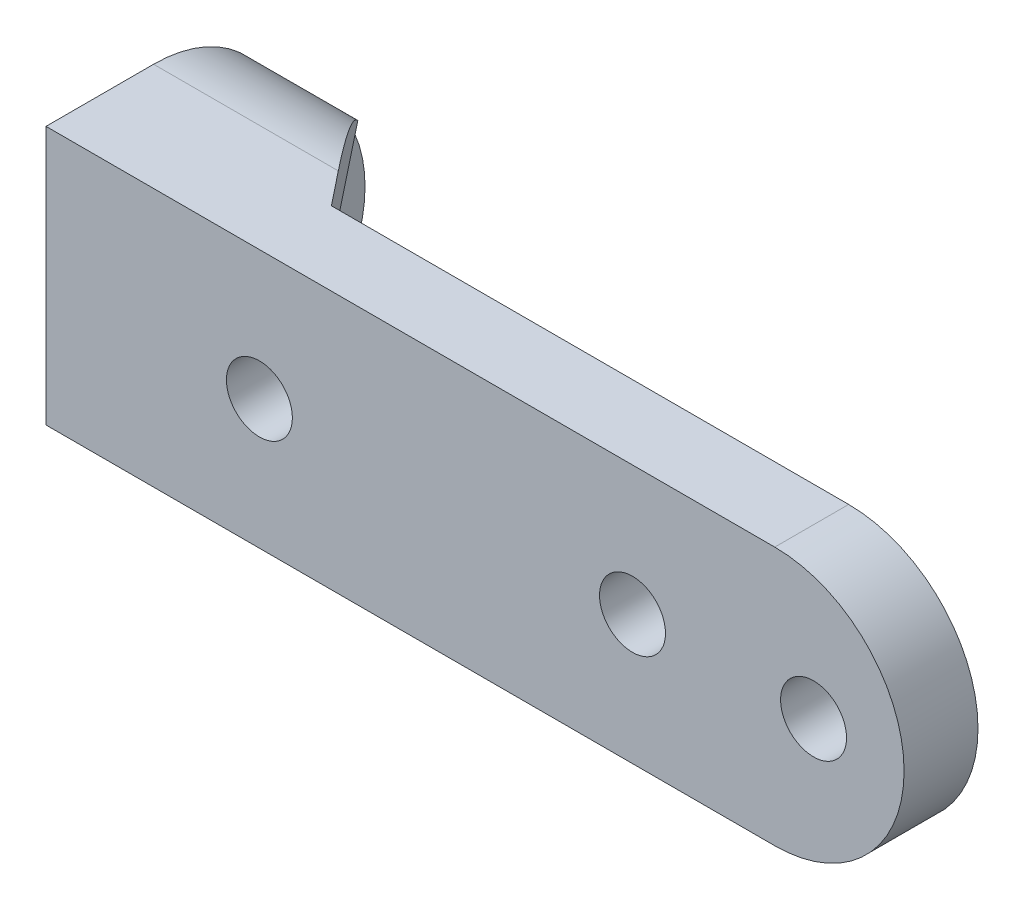
ISO-10303-21;
HEADER;
FILE_DESCRIPTION(('STEP AP214'),'2;1');
FILE_NAME('part.step','',(''),(''),'','','');
FILE_SCHEMA(('AUTOMOTIVE_DESIGN { 1 0 10303 214 1 1 1 1 }'));
ENDSEC;
DATA;
#1=APPLICATION_CONTEXT('core data for automotive mechanical design processes');
#2=APPLICATION_PROTOCOL_DEFINITION('international standard','automotive_design',2000,#1);
#3=PRODUCT_CONTEXT('',#1,'mechanical');
#4=PRODUCT('Part','Part','',(#3));
#5=PRODUCT_RELATED_PRODUCT_CATEGORY('part','',(#4));
#6=PRODUCT_DEFINITION_FORMATION('','',#4);
#7=PRODUCT_DEFINITION_CONTEXT('part definition',#1,'design');
#8=PRODUCT_DEFINITION('design','',#6,#7);
#9=PRODUCT_DEFINITION_SHAPE('','',#8);
#10=(LENGTH_UNIT() NAMED_UNIT(*) SI_UNIT(.MILLI.,.METRE.));
#11=(NAMED_UNIT(*) PLANE_ANGLE_UNIT() SI_UNIT($,.RADIAN.));
#12=(NAMED_UNIT(*) SI_UNIT($,.STERADIAN.) SOLID_ANGLE_UNIT());
#13=UNCERTAINTY_MEASURE_WITH_UNIT(LENGTH_MEASURE(1.E-05),#10,'distance_accuracy_value','');
#14=(GEOMETRIC_REPRESENTATION_CONTEXT(3) GLOBAL_UNCERTAINTY_ASSIGNED_CONTEXT((#13)) GLOBAL_UNIT_ASSIGNED_CONTEXT((#10,
#11,#12)) REPRESENTATION_CONTEXT('',''));
#15=CARTESIAN_POINT('',(0.,0.,0.));
#16=DIRECTION('',(0.,0.,1.));
#17=DIRECTION('',(1.,0.,0.));
#18=AXIS2_PLACEMENT_3D('',#15,#16,#17);
#19=CARTESIAN_POINT('',(-10.882391074901,-6.825,8.63418757078096));
#20=DIRECTION('',(-0.783381109212275,0.,0.621541662102667));
#21=DIRECTION('',(0.621541662102667,0.,0.783381109212275));
#22=AXIS2_PLACEMENT_3D('',#19,#20,#21);
#23=PLANE('',#22);
#24=CARTESIAN_POINT('',(-22.0659094941968,0.,-5.46133908235703));
#25=DIRECTION('',(-0.783381109212275,0.,0.621541662102667));
#26=DIRECTION('',(-0.621541662102667,0.,-0.783381109212275));
#27=AXIS2_PLACEMENT_3D('',#24,#25,#26);
#28=ELLIPSE('',#27,12.7651788923726,10.);
#29=CARTESIAN_POINT('',(-27.8648219381481,-6.82500000000001,-12.770195011981));
#30=VERTEX_POINT('',#29);
#31=CARTESIAN_POINT('',(-22.0659094941968,-10.,-5.46133908235703));
#32=VERTEX_POINT('',#31);
#33=EDGE_CURVE('E194',#30,#32,#28,.T.);
#34=ORIENTED_EDGE('',*,*,#33,.F.);
#35=DIRECTION('',(-0.621541662102668,0.,-0.783381109212275));
#36=VECTOR('',#35,1.);
#37=CARTESIAN_POINT('',(-10.882391074901,-6.825,8.63418757078096));
#38=LINE('',#37,#36);
#39=CARTESIAN_POINT('',(-21.5868181011606,-6.825,-4.8575));
#40=VERTEX_POINT('',#39);
#41=EDGE_CURVE('E205',#40,#30,#38,.T.);
#42=ORIENTED_EDGE('',*,*,#41,.F.);
#43=CARTESIAN_POINT('',(-21.5868181011606,-4.825,-4.8575));
#44=DIRECTION('',(-0.783381109212275,0.,0.621541662102667));
#45=DIRECTION('',(0.621541662102667,0.,0.783381109212275));
#46=AXIS2_PLACEMENT_3D('',#43,#44,#45);
#47=ELLIPSE('',#46,2.55303577847453,2.);
#48=CARTESIAN_POINT('',(-20.,-4.825,-2.8575));
#49=VERTEX_POINT('',#48);
#50=EDGE_CURVE('E302',#40,#49,#47,.T.);
#51=ORIENTED_EDGE('',*,*,#50,.T.);
#52=DIRECTION('',(0.,-1.,0.));
#53=VECTOR('',#52,1.);
#54=CARTESIAN_POINT('',(-20.,-6.825,-2.8575));
#55=LINE('',#54,#53);
#56=CARTESIAN_POINT('',(-20.,-10.,-2.8575));
#57=VERTEX_POINT('',#56);
#58=EDGE_CURVE('E204',#49,#57,#55,.T.);
#59=ORIENTED_EDGE('',*,*,#58,.T.);
#60=DIRECTION('',(-0.621541662102668,0.,-0.783381109212275));
#61=VECTOR('',#60,1.);
#62=CARTESIAN_POINT('',(-10.882391074901,-10.,8.63418757078096));
#63=LINE('',#62,#61);
#64=EDGE_CURVE('E184',#57,#32,#63,.T.);
#65=ORIENTED_EDGE('',*,*,#64,.T.);
#66=EDGE_LOOP('',(#34,#42,#51,#59,#65));
#67=FACE_BOUND('',#66,.T.);
#68=ADVANCED_FACE('F76',(#67),#23,.F.);
#69=CARTESIAN_POINT('',(0.,-6.825,0.));
#70=DIRECTION('',(0.,-1.,0.));
#71=DIRECTION('',(-1.,0.,0.));
#72=AXIS2_PLACEMENT_3D('',#69,#70,#71);
#73=PLANE('',#72);
#74=DIRECTION('',(0.,0.,-1.));
#75=VECTOR('',#74,1.);
#76=CARTESIAN_POINT('',(-28.,-6.825,0.));
#77=LINE('',#76,#75);
#78=CARTESIAN_POINT('',(-28.,-6.82500000000002,-12.770195011981));
#79=VERTEX_POINT('',#78);
#80=CARTESIAN_POINT('',(-28.,-6.825,-4.8575));
#81=VERTEX_POINT('',#80);
#82=EDGE_CURVE('E292',#79,#81,#77,.F.);
#83=ORIENTED_EDGE('',*,*,#82,.T.);
#84=DIRECTION('',(-1.,0.,0.));
#85=VECTOR('',#84,1.);
#86=CARTESIAN_POINT('',(-20.,-6.825,-4.8575));
#87=LINE('',#86,#85);
#88=EDGE_CURVE('E294',#81,#40,#87,.F.);
#89=ORIENTED_EDGE('',*,*,#88,.T.);
#90=ORIENTED_EDGE('',*,*,#41,.T.);
#91=DIRECTION('',(-1.,0.,0.));
#92=VECTOR('',#91,1.);
#93=CARTESIAN_POINT('',(30.,-6.82500000000001,-12.770195011981));
#94=LINE('',#93,#92);
#95=EDGE_CURVE('E197',#79,#30,#94,.F.);
#96=ORIENTED_EDGE('',*,*,#95,.F.);
#97=EDGE_LOOP('',(#83,#89,#90,#96));
#98=FACE_BOUND('',#97,.T.);
#99=ADVANCED_FACE('F344',(#98),#73,.F.);
#100=CARTESIAN_POINT('',(-10.882391074901,6.825,8.63418757078096));
#101=DIRECTION('',(0.783381109212275,0.,-0.621541662102667));
#102=DIRECTION('',(-0.621541662102667,0.,-0.783381109212275));
#103=AXIS2_PLACEMENT_3D('',#100,#101,#102);
#104=PLANE('',#103);
#105=DIRECTION('',(0.,1.,0.));
#106=VECTOR('',#105,1.);
#107=CARTESIAN_POINT('',(-20.,6.825,-2.8575));
#108=LINE('',#107,#106);
#109=CARTESIAN_POINT('',(-20.,4.825,-2.8575));
#110=VERTEX_POINT('',#109);
#111=CARTESIAN_POINT('',(-20.,10.,-2.8575));
#112=VERTEX_POINT('',#111);
#113=EDGE_CURVE('E215',#110,#112,#108,.T.);
#114=ORIENTED_EDGE('',*,*,#113,.F.);
#115=CARTESIAN_POINT('',(-21.5868181011606,4.825,-4.8575));
#116=DIRECTION('',(0.783381109212275,0.,-0.621541662102667));
#117=DIRECTION('',(0.621541662102667,0.,0.783381109212275));
#118=AXIS2_PLACEMENT_3D('',#115,#116,#117);
#119=ELLIPSE('',#118,2.55303577847453,2.);
#120=CARTESIAN_POINT('',(-21.5868181011606,6.825,-4.8575));
#121=VERTEX_POINT('',#120);
#122=EDGE_CURVE('E300',#110,#121,#119,.F.);
#123=ORIENTED_EDGE('',*,*,#122,.T.);
#124=DIRECTION('',(-0.621541662102668,0.,-0.783381109212275));
#125=VECTOR('',#124,1.);
#126=CARTESIAN_POINT('',(-10.882391074901,6.825,8.63418757078096));
#127=LINE('',#126,#125);
#128=CARTESIAN_POINT('',(-27.8648219381481,6.825,-12.770195011981));
#129=VERTEX_POINT('',#128);
#130=EDGE_CURVE('E213',#121,#129,#127,.T.);
#131=ORIENTED_EDGE('',*,*,#130,.T.);
#132=CARTESIAN_POINT('',(-22.0659094941968,0.,-5.46133908235703));
#133=DIRECTION('',(0.783381109212275,0.,-0.621541662102667));
#134=DIRECTION('',(-0.621541662102667,0.,-0.783381109212275));
#135=AXIS2_PLACEMENT_3D('',#132,#133,#134);
#136=ELLIPSE('',#135,12.7651788923726,10.);
#137=CARTESIAN_POINT('',(-22.0659094941968,10.,-5.46133908235703));
#138=VERTEX_POINT('',#137);
#139=EDGE_CURVE('E200',#129,#138,#136,.T.);
#140=ORIENTED_EDGE('',*,*,#139,.T.);
#141=DIRECTION('',(-0.621541662102668,0.,-0.783381109212275));
#142=VECTOR('',#141,1.);
#143=CARTESIAN_POINT('',(-10.882391074901,10.,8.63418757078096));
#144=LINE('',#143,#142);
#145=EDGE_CURVE('E212',#112,#138,#144,.T.);
#146=ORIENTED_EDGE('',*,*,#145,.F.);
#147=EDGE_LOOP('',(#114,#123,#131,#140,#146));
#148=FACE_BOUND('',#147,.T.);
#149=ADVANCED_FACE('F349',(#148),#104,.T.);
#150=CARTESIAN_POINT('',(0.,6.825,0.));
#151=DIRECTION('',(0.,1.,0.));
#152=DIRECTION('',(-1.,0.,0.));
#153=AXIS2_PLACEMENT_3D('',#150,#151,#152);
#154=PLANE('',#153);
#155=ORIENTED_EDGE('',*,*,#130,.F.);
#156=DIRECTION('',(-1.,0.,0.));
#157=VECTOR('',#156,1.);
#158=CARTESIAN_POINT('',(-30.,6.825,-4.8575));
#159=LINE('',#158,#157);
#160=CARTESIAN_POINT('',(-28.,6.825,-4.8575));
#161=VERTEX_POINT('',#160);
#162=EDGE_CURVE('E282',#121,#161,#159,.T.);
#163=ORIENTED_EDGE('',*,*,#162,.T.);
#164=DIRECTION('',(0.,0.,-1.));
#165=VECTOR('',#164,1.);
#166=CARTESIAN_POINT('',(-28.,6.825,0.));
#167=LINE('',#166,#165);
#168=CARTESIAN_POINT('',(-28.,6.825,-12.770195011981));
#169=VERTEX_POINT('',#168);
#170=EDGE_CURVE('E277',#161,#169,#167,.T.);
#171=ORIENTED_EDGE('',*,*,#170,.T.);
#172=DIRECTION('',(-1.,0.,0.));
#173=VECTOR('',#172,1.);
#174=CARTESIAN_POINT('',(30.,6.82500000000001,-12.770195011981));
#175=LINE('',#174,#173);
#176=EDGE_CURVE('E266',#129,#169,#175,.T.);
#177=ORIENTED_EDGE('',*,*,#176,.F.);
#178=EDGE_LOOP('',(#155,#163,#171,#177));
#179=FACE_BOUND('',#178,.T.);
#180=ADVANCED_FACE('F353',(#179),#154,.F.);
#181=CARTESIAN_POINT('',(-30.,0.,0.));
#182=DIRECTION('',(1.,0.,0.));
#183=DIRECTION('',(0.,1.,0.));
#184=AXIS2_PLACEMENT_3D('',#181,#182,#183);
#185=PLANE('',#184);
#186=CARTESIAN_POINT('',(-30.,0.,-5.46133908235703));
#187=DIRECTION('',(1.,0.,0.));
#188=DIRECTION('',(0.,1.,0.));
#189=AXIS2_PLACEMENT_3D('',#186,#187,#188);
#190=CIRCLE('',#189,10.);
#191=CARTESIAN_POINT('',(-30.,-4.825,-14.22029878086));
#192=VERTEX_POINT('',#191);
#193=CARTESIAN_POINT('',(-30.,4.825,-14.22029878086));
#194=VERTEX_POINT('',#193);
#195=EDGE_CURVE('E189',#192,#194,#190,.T.);
#196=ORIENTED_EDGE('',*,*,#195,.T.);
#197=DIRECTION('',(0.,0.,-1.));
#198=VECTOR('',#197,1.);
#199=CARTESIAN_POINT('',(-30.,4.825,0.));
#200=LINE('',#199,#198);
#201=CARTESIAN_POINT('',(-30.,4.825,-4.8575));
#202=VERTEX_POINT('',#201);
#203=EDGE_CURVE('E99',#194,#202,#200,.F.);
#204=ORIENTED_EDGE('',*,*,#203,.T.);
#205=DIRECTION('',(0.,-1.,0.));
#206=VECTOR('',#205,1.);
#207=CARTESIAN_POINT('',(-30.,0.,-4.8575));
#208=LINE('',#207,#206);
#209=CARTESIAN_POINT('',(-30.,-4.825,-4.8575));
#210=VERTEX_POINT('',#209);
#211=EDGE_CURVE('E94',#202,#210,#208,.T.);
#212=ORIENTED_EDGE('',*,*,#211,.T.);
#213=DIRECTION('',(0.,0.,-1.));
#214=VECTOR('',#213,1.);
#215=CARTESIAN_POINT('',(-30.,-4.825,0.));
#216=LINE('',#215,#214);
#217=EDGE_CURVE('E297',#210,#192,#216,.T.);
#218=ORIENTED_EDGE('',*,*,#217,.T.);
#219=EDGE_LOOP('',(#196,#204,#212,#218));
#220=FACE_BOUND('',#219,.T.);
#221=CARTESIAN_POINT('',(-30.,0.,-9.14249999999994));
#222=DIRECTION('',(1.,0.,0.));
#223=DIRECTION('',(0.,1.,0.));
#224=AXIS2_PLACEMENT_3D('',#221,#222,#223);
#225=CIRCLE('',#224,2.55);
#226=CARTESIAN_POINT('',(-30.,2.55,-9.14249999999994));
#227=VERTEX_POINT('',#226);
#228=EDGE_CURVE('E219',#227,#227,#225,.T.);
#229=ORIENTED_EDGE('',*,*,#228,.F.);
#230=EDGE_LOOP('',(#229));
#231=FACE_BOUND('',#230,.T.);
#232=ADVANCED_FACE('F356',(#220,#231),#185,.T.);
#233=CARTESIAN_POINT('',(0.,0.,-2.8575));
#234=DIRECTION('',(0.,0.,1.));
#235=DIRECTION('',(1.,0.,0.));
#236=AXIS2_PLACEMENT_3D('',#233,#234,#235);
#237=PLANE('',#236);
#238=CARTESIAN_POINT('',(23.,0.,-2.8575));
#239=DIRECTION('',(0.,0.,1.));
#240=DIRECTION('',(1.,0.,0.));
#241=AXIS2_PLACEMENT_3D('',#238,#239,#240);
#242=CIRCLE('',#241,2.55);
#243=CARTESIAN_POINT('',(25.55,0.,-2.8575));
#244=VERTEX_POINT('',#243);
#245=EDGE_CURVE('E233',#244,#244,#242,.T.);
#246=ORIENTED_EDGE('',*,*,#245,.T.);
#247=EDGE_LOOP('',(#246));
#248=FACE_BOUND('',#247,.T.);
#249=CARTESIAN_POINT('',(9.,0.,-2.8575));
#250=DIRECTION('',(0.,0.,1.));
#251=DIRECTION('',(1.,0.,0.));
#252=AXIS2_PLACEMENT_3D('',#249,#250,#251);
#253=CIRCLE('',#252,2.55);
#254=CARTESIAN_POINT('',(11.55,0.,-2.8575));
#255=VERTEX_POINT('',#254);
#256=EDGE_CURVE('E234',#255,#255,#253,.T.);
#257=ORIENTED_EDGE('',*,*,#256,.T.);
#258=EDGE_LOOP('',(#257));
#259=FACE_BOUND('',#258,.T.);
#260=CARTESIAN_POINT('',(-19.85,0.,-2.8575));
#261=DIRECTION('',(0.,0.,1.));
#262=DIRECTION('',(1.,0.,0.));
#263=AXIS2_PLACEMENT_3D('',#260,#261,#262);
#264=CIRCLE('',#263,2.55);
#265=CARTESIAN_POINT('',(-17.3,0.,-2.8575));
#266=VERTEX_POINT('',#265);
#267=EDGE_CURVE('E230',#266,#266,#264,.F.);
#268=ORIENTED_EDGE('',*,*,#267,.F.);
#269=EDGE_LOOP('',(#268));
#270=FACE_BOUND('',#269,.T.);
#271=DIRECTION('',(-1.,0.,0.));
#272=VECTOR('',#271,1.);
#273=CARTESIAN_POINT('',(-20.,4.825,-2.8575));
#274=LINE('',#273,#272);
#275=CARTESIAN_POINT('',(-28.,4.825,-2.8575));
#276=VERTEX_POINT('',#275);
#277=EDGE_CURVE('E289',#276,#110,#274,.F.);
#278=ORIENTED_EDGE('',*,*,#277,.T.);
#279=ORIENTED_EDGE('',*,*,#113,.T.);
#280=DIRECTION('',(-1.,0.,0.));
#281=VECTOR('',#280,1.);
#282=CARTESIAN_POINT('',(0.,10.,-2.8575));
#283=LINE('',#282,#281);
#284=CARTESIAN_POINT('',(20.,10.,-2.8575));
#285=VERTEX_POINT('',#284);
#286=EDGE_CURVE('E249',#285,#112,#283,.T.);
#287=ORIENTED_EDGE('',*,*,#286,.F.);
#288=CARTESIAN_POINT('',(20.,0.,-2.8575));
#289=DIRECTION('',(0.,0.,1.));
#290=DIRECTION('',(1.,0.,0.));
#291=AXIS2_PLACEMENT_3D('',#288,#289,#290);
#292=CIRCLE('',#291,10.);
#293=CARTESIAN_POINT('',(20.,-10.,-2.8575));
#294=VERTEX_POINT('',#293);
#295=EDGE_CURVE('E255',#294,#285,#292,.T.);
#296=ORIENTED_EDGE('',*,*,#295,.F.);
#297=DIRECTION('',(-1.,0.,0.));
#298=VECTOR('',#297,1.);
#299=CARTESIAN_POINT('',(0.,-10.,-2.8575));
#300=LINE('',#299,#298);
#301=EDGE_CURVE('E245',#294,#57,#300,.T.);
#302=ORIENTED_EDGE('',*,*,#301,.T.);
#303=ORIENTED_EDGE('',*,*,#58,.F.);
#304=DIRECTION('',(-1.,0.,0.));
#305=VECTOR('',#304,1.);
#306=CARTESIAN_POINT('',(-30.,-4.825,-2.8575));
#307=LINE('',#306,#305);
#308=CARTESIAN_POINT('',(-28.,-4.825,-2.8575));
#309=VERTEX_POINT('',#308);
#310=EDGE_CURVE('E287',#49,#309,#307,.T.);
#311=ORIENTED_EDGE('',*,*,#310,.T.);
#312=DIRECTION('',(0.,-1.,0.));
#313=VECTOR('',#312,1.);
#314=CARTESIAN_POINT('',(-28.,0.,-2.8575));
#315=LINE('',#314,#313);
#316=EDGE_CURVE('E285',#309,#276,#315,.F.);
#317=ORIENTED_EDGE('',*,*,#316,.T.);
#318=EDGE_LOOP('',(#278,#279,#287,#296,#302,#303,#311,#317));
#319=FACE_BOUND('',#318,.T.);
#320=ADVANCED_FACE('F370',(#248,#259,#270,#319),#237,.F.);
#321=CARTESIAN_POINT('',(0.,-10.,2.8575));
#322=DIRECTION('',(0.,-1.,0.));
#323=DIRECTION('',(1.,0.,0.));
#324=AXIS2_PLACEMENT_3D('',#321,#322,#323);
#325=PLANE('',#324);
#326=DIRECTION('',(1.,0.,0.));
#327=VECTOR('',#326,1.);
#328=CARTESIAN_POINT('',(-30.,-10.,-5.46133908235703));
#329=LINE('',#328,#327);
#330=CARTESIAN_POINT('',(-36.35,-10.,-5.46133908235703));
#331=VERTEX_POINT('',#330);
#332=EDGE_CURVE('E179',#331,#32,#329,.T.);
#333=ORIENTED_EDGE('',*,*,#332,.T.);
#334=ORIENTED_EDGE('',*,*,#64,.F.);
#335=ORIENTED_EDGE('',*,*,#301,.F.);
#336=DIRECTION('',(0.,0.,-1.));
#337=VECTOR('',#336,1.);
#338=CARTESIAN_POINT('',(20.,-10.,2.8575));
#339=LINE('',#338,#337);
#340=CARTESIAN_POINT('',(20.,-10.,2.8575));
#341=VERTEX_POINT('',#340);
#342=EDGE_CURVE('E190',#341,#294,#339,.T.);
#343=ORIENTED_EDGE('',*,*,#342,.F.);
#344=DIRECTION('',(-1.,0.,0.));
#345=VECTOR('',#344,1.);
#346=CARTESIAN_POINT('',(0.,-10.,2.8575));
#347=LINE('',#346,#345);
#348=CARTESIAN_POINT('',(-36.35,-10.,2.8575));
#349=VERTEX_POINT('',#348);
#350=EDGE_CURVE('E246',#341,#349,#347,.T.);
#351=ORIENTED_EDGE('',*,*,#350,.T.);
#352=DIRECTION('',(0.,0.,1.));
#353=VECTOR('',#352,1.);
#354=CARTESIAN_POINT('',(-36.35,-10.,2.8575));
#355=LINE('',#354,#353);
#356=EDGE_CURVE('E186',#331,#349,#355,.T.);
#357=ORIENTED_EDGE('',*,*,#356,.F.);
#358=EDGE_LOOP('',(#333,#334,#335,#343,#351,#357));
#359=FACE_BOUND('',#358,.T.);
#360=ADVANCED_FACE('F181',(#359),#325,.T.);
#361=CARTESIAN_POINT('',(20.,0.,2.8575));
#362=DIRECTION('',(0.,0.,-1.));
#363=DIRECTION('',(-1.,0.,0.));
#364=AXIS2_PLACEMENT_3D('',#361,#362,#363);
#365=CYLINDRICAL_SURFACE('',#364,10.);
#366=ORIENTED_EDGE('',*,*,#295,.T.);
#367=DIRECTION('',(0.,0.,-1.));
#368=VECTOR('',#367,1.);
#369=CARTESIAN_POINT('',(20.,10.,2.8575));
#370=LINE('',#369,#368);
#371=CARTESIAN_POINT('',(20.,10.,2.8575));
#372=VERTEX_POINT('',#371);
#373=EDGE_CURVE('E253',#372,#285,#370,.T.);
#374=ORIENTED_EDGE('',*,*,#373,.F.);
#375=CARTESIAN_POINT('',(20.,0.,2.8575));
#376=DIRECTION('',(0.,0.,1.));
#377=DIRECTION('',(1.,0.,0.));
#378=AXIS2_PLACEMENT_3D('',#375,#376,#377);
#379=CIRCLE('',#378,10.);
#380=EDGE_CURVE('E248',#341,#372,#379,.T.);
#381=ORIENTED_EDGE('',*,*,#380,.F.);
#382=ORIENTED_EDGE('',*,*,#342,.T.);
#383=EDGE_LOOP('',(#366,#374,#381,#382));
#384=FACE_BOUND('',#383,.T.);
#385=ADVANCED_FACE('F391',(#384),#365,.T.);
#386=CARTESIAN_POINT('',(0.,10.,2.8575));
#387=DIRECTION('',(0.,-1.,0.));
#388=DIRECTION('',(1.,0.,0.));
#389=AXIS2_PLACEMENT_3D('',#386,#387,#388);
#390=PLANE('',#389);
#391=ORIENTED_EDGE('',*,*,#145,.T.);
#392=DIRECTION('',(1.,0.,0.));
#393=VECTOR('',#392,1.);
#394=CARTESIAN_POINT('',(0.,10.,-5.46133908235703));
#395=LINE('',#394,#393);
#396=CARTESIAN_POINT('',(-36.35,10.,-5.46133908235703));
#397=VERTEX_POINT('',#396);
#398=EDGE_CURVE('E269',#138,#397,#395,.F.);
#399=ORIENTED_EDGE('',*,*,#398,.T.);
#400=DIRECTION('',(0.,0.,-1.));
#401=VECTOR('',#400,1.);
#402=CARTESIAN_POINT('',(-36.35,10.,2.8575));
#403=LINE('',#402,#401);
#404=CARTESIAN_POINT('',(-36.35,10.,2.8575));
#405=VERTEX_POINT('',#404);
#406=EDGE_CURVE('E226',#405,#397,#403,.T.);
#407=ORIENTED_EDGE('',*,*,#406,.F.);
#408=DIRECTION('',(-1.,0.,0.));
#409=VECTOR('',#408,1.);
#410=CARTESIAN_POINT('',(0.,10.,2.8575));
#411=LINE('',#410,#409);
#412=EDGE_CURVE('E251',#372,#405,#411,.T.);
#413=ORIENTED_EDGE('',*,*,#412,.F.);
#414=ORIENTED_EDGE('',*,*,#373,.T.);
#415=ORIENTED_EDGE('',*,*,#286,.T.);
#416=EDGE_LOOP('',(#391,#399,#407,#413,#414,#415));
#417=FACE_BOUND('',#416,.T.);
#418=ADVANCED_FACE('F385',(#417),#390,.F.);
#419=CARTESIAN_POINT('',(0.,0.,2.8575));
#420=DIRECTION('',(0.,0.,1.));
#421=DIRECTION('',(1.,0.,0.));
#422=AXIS2_PLACEMENT_3D('',#419,#420,#421);
#423=PLANE('',#422);
#424=CARTESIAN_POINT('',(-19.85,0.,2.8575));
#425=DIRECTION('',(0.,0.,1.));
#426=DIRECTION('',(1.,0.,0.));
#427=AXIS2_PLACEMENT_3D('',#424,#425,#426);
#428=CIRCLE('',#427,2.55);
#429=CARTESIAN_POINT('',(-17.3,0.,2.8575));
#430=VERTEX_POINT('',#429);
#431=EDGE_CURVE('E227',#430,#430,#428,.T.);
#432=ORIENTED_EDGE('',*,*,#431,.F.);
#433=EDGE_LOOP('',(#432));
#434=FACE_BOUND('',#433,.T.);
#435=CARTESIAN_POINT('',(9.,0.,2.8575));
#436=DIRECTION('',(0.,0.,1.));
#437=DIRECTION('',(1.,0.,0.));
#438=AXIS2_PLACEMENT_3D('',#435,#436,#437);
#439=CIRCLE('',#438,2.55);
#440=CARTESIAN_POINT('',(11.55,0.,2.8575));
#441=VERTEX_POINT('',#440);
#442=EDGE_CURVE('E242',#441,#441,#439,.T.);
#443=ORIENTED_EDGE('',*,*,#442,.F.);
#444=EDGE_LOOP('',(#443));
#445=FACE_BOUND('',#444,.T.);
#446=CARTESIAN_POINT('',(23.,0.,2.8575));
#447=DIRECTION('',(0.,0.,1.));
#448=DIRECTION('',(1.,0.,0.));
#449=AXIS2_PLACEMENT_3D('',#446,#447,#448);
#450=CIRCLE('',#449,2.55);
#451=CARTESIAN_POINT('',(25.55,0.,2.8575));
#452=VERTEX_POINT('',#451);
#453=EDGE_CURVE('E237',#452,#452,#450,.T.);
#454=ORIENTED_EDGE('',*,*,#453,.F.);
#455=EDGE_LOOP('',(#454));
#456=FACE_BOUND('',#455,.T.);
#457=ORIENTED_EDGE('',*,*,#412,.T.);
#458=DIRECTION('',(0.,1.,0.));
#459=VECTOR('',#458,1.);
#460=CARTESIAN_POINT('',(-36.35,10.,2.8575));
#461=LINE('',#460,#459);
#462=EDGE_CURVE('E223',#349,#405,#461,.T.);
#463=ORIENTED_EDGE('',*,*,#462,.F.);
#464=ORIENTED_EDGE('',*,*,#350,.F.);
#465=ORIENTED_EDGE('',*,*,#380,.T.);
#466=EDGE_LOOP('',(#457,#463,#464,#465));
#467=FACE_BOUND('',#466,.T.);
#468=ADVANCED_FACE('F381',(#434,#445,#456,#467),#423,.T.);
#469=CARTESIAN_POINT('',(23.,0.,-2.8575));
#470=DIRECTION('',(0.,0.,1.));
#471=DIRECTION('',(1.,0.,0.));
#472=AXIS2_PLACEMENT_3D('',#469,#470,#471);
#473=CYLINDRICAL_SURFACE('',#472,2.55);
#474=ORIENTED_EDGE('',*,*,#453,.T.);
#475=EDGE_LOOP('',(#474));
#476=FACE_BOUND('',#475,.T.);
#477=ORIENTED_EDGE('',*,*,#245,.F.);
#478=EDGE_LOOP('',(#477));
#479=FACE_BOUND('',#478,.T.);
#480=ADVANCED_FACE('F377',(#476,#479),#473,.F.);
#481=CARTESIAN_POINT('',(9.,0.,-2.8575));
#482=DIRECTION('',(0.,0.,1.));
#483=DIRECTION('',(1.,0.,0.));
#484=AXIS2_PLACEMENT_3D('',#481,#482,#483);
#485=CYLINDRICAL_SURFACE('',#484,2.55);
#486=ORIENTED_EDGE('',*,*,#442,.T.);
#487=EDGE_LOOP('',(#486));
#488=FACE_BOUND('',#487,.T.);
#489=ORIENTED_EDGE('',*,*,#256,.F.);
#490=EDGE_LOOP('',(#489));
#491=FACE_BOUND('',#490,.T.);
#492=ADVANCED_FACE('F373',(#488,#491),#485,.F.);
#493=CARTESIAN_POINT('',(-19.85,0.,-10.0699891681028));
#494=DIRECTION('',(0.,0.,1.));
#495=DIRECTION('',(1.,0.,0.));
#496=AXIS2_PLACEMENT_3D('',#493,#494,#495);
#497=CYLINDRICAL_SURFACE('',#496,2.55);
#498=ORIENTED_EDGE('',*,*,#267,.T.);
#499=EDGE_LOOP('',(#498));
#500=FACE_BOUND('',#499,.T.);
#501=ORIENTED_EDGE('',*,*,#431,.T.);
#502=EDGE_LOOP('',(#501));
#503=FACE_BOUND('',#502,.T.);
#504=ADVANCED_FACE('F366',(#500,#503),#497,.F.);
#505=CARTESIAN_POINT('',(-36.35,0.,0.));
#506=DIRECTION('',(1.,0.,0.));
#507=DIRECTION('',(0.,1.,0.));
#508=AXIS2_PLACEMENT_3D('',#505,#506,#507);
#509=PLANE('',#508);
#510=CARTESIAN_POINT('',(-36.35,0.,-9.14249999999994));
#511=DIRECTION('',(1.,0.,0.));
#512=DIRECTION('',(0.,1.,0.));
#513=AXIS2_PLACEMENT_3D('',#510,#511,#512);
#514=CIRCLE('',#513,2.55);
#515=CARTESIAN_POINT('',(-36.35,2.54999999999999,-9.14249999999994));
#516=VERTEX_POINT('',#515);
#517=EDGE_CURVE('E220',#516,#516,#514,.T.);
#518=ORIENTED_EDGE('',*,*,#517,.T.);
#519=EDGE_LOOP('',(#518));
#520=FACE_BOUND('',#519,.T.);
#521=CARTESIAN_POINT('',(-36.35,0.,-5.46133908235703));
#522=DIRECTION('',(1.,0.,0.));
#523=DIRECTION('',(0.,1.,0.));
#524=AXIS2_PLACEMENT_3D('',#521,#522,#523);
#525=CIRCLE('',#524,10.);
#526=EDGE_CURVE('E263',#397,#331,#525,.F.);
#527=ORIENTED_EDGE('',*,*,#526,.T.);
#528=ORIENTED_EDGE('',*,*,#356,.T.);
#529=ORIENTED_EDGE('',*,*,#462,.T.);
#530=ORIENTED_EDGE('',*,*,#406,.T.);
#531=EDGE_LOOP('',(#527,#528,#529,#530));
#532=FACE_BOUND('',#531,.T.);
#533=ADVANCED_FACE('F324',(#520,#532),#509,.F.);
#534=CARTESIAN_POINT('',(-36.35,0.,-5.46133908235703));
#535=DIRECTION('',(1.,0.,0.));
#536=DIRECTION('',(0.,1.,0.));
#537=AXIS2_PLACEMENT_3D('',#534,#535,#536);
#538=CYLINDRICAL_SURFACE('',#537,10.);
#539=ORIENTED_EDGE('',*,*,#332,.F.);
#540=ORIENTED_EDGE('',*,*,#526,.F.);
#541=ORIENTED_EDGE('',*,*,#398,.F.);
#542=ORIENTED_EDGE('',*,*,#139,.F.);
#543=ORIENTED_EDGE('',*,*,#176,.T.);
#544=CARTESIAN_POINT('',(-28.,6.825,-12.770195011981));
#545=CARTESIAN_POINT('',(-28.0467209034633,6.82501166267394,-12.7701799689998));
#546=CARTESIAN_POINT('',(-28.0934312480368,6.8233633035982,-12.7717232791897));
#547=CARTESIAN_POINT('',(-28.1863871244677,6.81683740604704,-12.7778111648082));
#548=CARTESIAN_POINT('',(-28.2326330441783,6.81196283777475,-12.7823529796598));
#549=CARTESIAN_POINT('',(-28.323882670373,6.799134281212,-12.7942678392704));
#550=CARTESIAN_POINT('',(-28.3688938858423,6.79120899475172,-12.8016144903888));
#551=CARTESIAN_POINT('',(-28.4577793597311,6.77243525915458,-12.8189395263139));
#552=CARTESIAN_POINT('',(-28.5016534125207,6.7615862853228,-12.8289183834984));
#553=CARTESIAN_POINT('',(-28.6308348808223,6.72500517207621,-12.8623792978052));
#554=CARTESIAN_POINT('',(-28.7141048640482,6.69517984395978,-12.8894415985834));
#555=CARTESIAN_POINT('',(-28.8737894362632,6.6261403404825,-12.9510925963005));
#556=CARTESIAN_POINT('',(-28.9501847029224,6.58690077289162,-12.985701624982));
#557=CARTESIAN_POINT('',(-29.1253348927937,6.48266450749159,-13.075899722842));
#558=CARTESIAN_POINT('',(-29.2203232446452,6.41371835549072,-13.1342558287034));
#559=CARTESIAN_POINT('',(-29.394612500315,6.26317958615822,-13.2576258920801));
#560=CARTESIAN_POINT('',(-29.4738912948658,6.1815694296172,-13.3226490401955));
#561=CARTESIAN_POINT('',(-29.617835296128,6.00638847567333,-13.4573203744597));
#562=CARTESIAN_POINT('',(-29.6822099088948,5.91262786749247,-13.5270309865613));
#563=CARTESIAN_POINT('',(-29.7939715397431,5.71630177643555,-13.6673402466755));
#564=CARTESIAN_POINT('',(-29.84137494611,5.61374490699316,-13.7379379694688));
#565=CARTESIAN_POINT('',(-29.9190211148838,5.39986189507589,-13.8790646032588));
#566=CARTESIAN_POINT('',(-29.9490079678904,5.28843106604554,-13.9495780012779));
#567=CARTESIAN_POINT('',(-29.9793755337715,5.11730337781171,-14.0530610167503));
#568=CARTESIAN_POINT('',(-29.9870629609671,5.05953639575456,-14.0872077694522));
#569=CARTESIAN_POINT('',(-29.9973742941399,4.94296858102624,-14.1545319806032));
#570=CARTESIAN_POINT('',(-29.9999963676472,4.88416738197102,-14.1877090839937));
#571=CARTESIAN_POINT('',(-30.,4.825,-14.22029878086));
#572=B_SPLINE_CURVE_WITH_KNOTS('',3,(#544,#545,#546,#547,#548,#549,#550,#551,#552,#553,#554,
#555,#556,#557,#558,#559,#560,#561,#562,#563,#564,#565,#566,#567,#568,#569,#570,#571),
.UNSPECIFIED.,.F.,.F.,(4,2,2,2,2,2,2,2,2,2,2,2,2,4),(0.,0.140091045819725,0.280053296168762,
0.418729723032234,0.557431053833929,0.83361592835342,1.11055427754928,1.50166700077847,
1.89332631742808,2.29207725454972,2.69044209165103,3.0945211569306,3.29697332811852,
3.49949872580036),.UNSPECIFIED.);
#573=EDGE_CURVE('E86',#169,#194,#572,.T.);
#574=ORIENTED_EDGE('',*,*,#573,.T.);
#575=ORIENTED_EDGE('',*,*,#195,.F.);
#576=CARTESIAN_POINT('',(-30.,-4.825,-14.22029878086));
#577=CARTESIAN_POINT('',(-29.9999972935996,-4.89987228550234,-14.1790690562171));
#578=CARTESIAN_POINT('',(-29.9957965691065,-4.97417278486506,-14.1368740813459));
#579=CARTESIAN_POINT('',(-29.9793561459178,-5.12097988451076,-14.0510261395052));
#580=CARTESIAN_POINT('',(-29.9671202093161,-5.19348730783634,-14.0073738639193));
#581=CARTESIAN_POINT('',(-29.9349553663424,-5.33617524366727,-13.9190158537313));
#582=CARTESIAN_POINT('',(-29.9150214922807,-5.40635422174044,-13.874309456404));
#583=CARTESIAN_POINT('',(-29.8677782863454,-5.54380955113098,-13.7843752017276));
#584=CARTESIAN_POINT('',(-29.8404688091358,-5.61108584522081,-13.7391473341197));
#585=CARTESIAN_POINT('',(-29.7551762373267,-5.79230903959815,-13.6141793306815));
#586=CARTESIAN_POINT('',(-29.6896716494803,-5.90278233088672,-13.5343855235202));
#587=CARTESIAN_POINT('',(-29.5374271777404,-6.11065439558979,-13.3782062756227));
#588=CARTESIAN_POINT('',(-29.4507061247864,-6.20806464522227,-13.3018178830603));
#589=CARTESIAN_POINT('',(-29.2786679055639,-6.36621861993198,-13.1736116335236));
#590=CARTESIAN_POINT('',(-29.1975809498791,-6.43024986558461,-13.1201740851578));
#591=CARTESIAN_POINT('',(-29.0232184984578,-6.54661801820706,-13.020943553965));
#592=CARTESIAN_POINT('',(-28.9299613893265,-6.59897224983951,-12.9751392718777));
#593=CARTESIAN_POINT('',(-28.7525977233715,-6.68000729583309,-12.9031013049508));
#594=CARTESIAN_POINT('',(-28.6705581029197,-6.71134273203505,-12.8747799608835));
#595=CARTESIAN_POINT('',(-28.5007005789965,-6.76333415430029,-12.8273800199176));
#596=CARTESIAN_POINT('',(-28.412896807579,-6.78401523488842,-12.8082797111793));
#597=CARTESIAN_POINT('',(-28.270340445049,-6.80737410681157,-12.7866239689026));
#598=CARTESIAN_POINT('',(-28.2167332528961,-6.81395499395874,-12.7804973922347));
#599=CARTESIAN_POINT('',(-28.1087655504873,-6.82277933182195,-12.7722688392755));
#600=CARTESIAN_POINT('',(-28.0544038912987,-6.82501521193397,-12.7701738876226));
#601=CARTESIAN_POINT('',(-28.,-6.825,-12.770195011981));
#602=B_SPLINE_CURVE_WITH_KNOTS('',3,(#576,#577,#578,#579,#580,#581,#582,#583,#584,#585,#586,
#587,#588,#589,#590,#591,#592,#593,#594,#595,#596,#597,#598,#599,#600,#601),.UNSPECIFIED.,.F.,
.F.,(4,2,2,2,2,2,2,2,2,2,2,2,4),(0.,0.256259224506635,0.512398553664285,0.76870345350815,
1.02501340419552,1.47650773206805,1.92760277509515,2.27535041868823,2.62257864094976,
2.89834323300067,3.17345530422299,3.33622113466606,3.49927030980992),.UNSPECIFIED.);
#603=EDGE_CURVE('E12',#192,#79,#602,.T.);
#604=ORIENTED_EDGE('',*,*,#603,.T.);
#605=ORIENTED_EDGE('',*,*,#95,.T.);
#606=ORIENTED_EDGE('',*,*,#33,.T.);
#607=EDGE_LOOP('',(#539,#540,#541,#542,#543,#574,#575,#604,#605,#606));
#608=FACE_BOUND('',#607,.T.);
#609=ADVANCED_FACE('F195',(#608),#538,.T.);
#610=CARTESIAN_POINT('',(30.,0.,-9.14249999999994));
#611=DIRECTION('',(-1.,0.,0.));
#612=DIRECTION('',(0.,-1.,0.));
#613=AXIS2_PLACEMENT_3D('',#610,#611,#612);
#614=CYLINDRICAL_SURFACE('',#613,2.55);
#615=ORIENTED_EDGE('',*,*,#228,.T.);
#616=EDGE_LOOP('',(#615));
#617=FACE_BOUND('',#616,.T.);
#618=ORIENTED_EDGE('',*,*,#517,.F.);
#619=EDGE_LOOP('',(#618));
#620=FACE_BOUND('',#619,.T.);
#621=ADVANCED_FACE('F323',(#617,#620),#614,.F.);
#622=CARTESIAN_POINT('',(-28.,-4.825,0.));
#623=DIRECTION('',(0.,0.,-1.));
#624=DIRECTION('',(-1.,0.,0.));
#625=AXIS2_PLACEMENT_3D('',#622,#623,#624);
#626=CYLINDRICAL_SURFACE('',#625,2.);
#627=ORIENTED_EDGE('',*,*,#603,.F.);
#628=ORIENTED_EDGE('',*,*,#217,.F.);
#629=CARTESIAN_POINT('',(-28.,-4.825,-4.8575));
#630=DIRECTION('',(0.,0.,-1.));
#631=DIRECTION('',(-1.,0.,0.));
#632=AXIS2_PLACEMENT_3D('',#629,#630,#631);
#633=CIRCLE('',#632,2.);
#634=EDGE_CURVE('E81',#81,#210,#633,.T.);
#635=ORIENTED_EDGE('',*,*,#634,.F.);
#636=ORIENTED_EDGE('',*,*,#82,.F.);
#637=EDGE_LOOP('',(#627,#628,#635,#636));
#638=FACE_BOUND('',#637,.T.);
#639=ADVANCED_FACE('F78',(#638),#626,.F.);
#640=CARTESIAN_POINT('',(0.,-4.825,-4.8575));
#641=DIRECTION('',(1.,0.,0.));
#642=DIRECTION('',(0.,1.,0.));
#643=AXIS2_PLACEMENT_3D('',#640,#641,#642);
#644=CYLINDRICAL_SURFACE('',#643,2.);
#645=ORIENTED_EDGE('',*,*,#50,.F.);
#646=ORIENTED_EDGE('',*,*,#88,.F.);
#647=CARTESIAN_POINT('',(-28.,-4.825,-4.8575));
#648=DIRECTION('',(1.,0.,0.));
#649=DIRECTION('',(0.,1.,0.));
#650=AXIS2_PLACEMENT_3D('',#647,#648,#649);
#651=CIRCLE('',#650,2.);
#652=EDGE_CURVE('E421',#309,#81,#651,.T.);
#653=ORIENTED_EDGE('',*,*,#652,.F.);
#654=ORIENTED_EDGE('',*,*,#310,.F.);
#655=EDGE_LOOP('',(#645,#646,#653,#654));
#656=FACE_BOUND('',#655,.T.);
#657=ADVANCED_FACE('F419',(#656),#644,.F.);
#658=CARTESIAN_POINT('',(-28.,-4.825,-4.8575));
#659=DIRECTION('',(0.,-1.,0.));
#660=DIRECTION('',(0.,0.,-1.));
#661=AXIS2_PLACEMENT_3D('',#658,#659,#660);
#662=SPHERICAL_SURFACE('',#661,2.);
#663=ORIENTED_EDGE('',*,*,#652,.T.);
#664=ORIENTED_EDGE('',*,*,#634,.T.);
#665=CARTESIAN_POINT('',(-28.,-4.825,-4.8575));
#666=DIRECTION('',(0.,1.,0.));
#667=DIRECTION('',(0.,0.,1.));
#668=AXIS2_PLACEMENT_3D('',#665,#666,#667);
#669=CIRCLE('',#668,2.);
#670=EDGE_CURVE('E426',#309,#210,#669,.F.);
#671=ORIENTED_EDGE('',*,*,#670,.F.);
#672=EDGE_LOOP('',(#663,#664,#671));
#673=FACE_BOUND('',#672,.T.);
#674=ADVANCED_FACE('F340',(#673),#662,.F.);
#675=CARTESIAN_POINT('',(-28.,4.825,0.));
#676=DIRECTION('',(0.,0.,-1.));
#677=DIRECTION('',(-1.,0.,0.));
#678=AXIS2_PLACEMENT_3D('',#675,#676,#677);
#679=CYLINDRICAL_SURFACE('',#678,2.);
#680=ORIENTED_EDGE('',*,*,#573,.F.);
#681=ORIENTED_EDGE('',*,*,#170,.F.);
#682=CARTESIAN_POINT('',(-28.,4.825,-4.8575));
#683=DIRECTION('',(0.,0.,-1.));
#684=DIRECTION('',(-1.,0.,0.));
#685=AXIS2_PLACEMENT_3D('',#682,#683,#684);
#686=CIRCLE('',#685,2.);
#687=EDGE_CURVE('E428',#202,#161,#686,.T.);
#688=ORIENTED_EDGE('',*,*,#687,.F.);
#689=ORIENTED_EDGE('',*,*,#203,.F.);
#690=EDGE_LOOP('',(#680,#681,#688,#689));
#691=FACE_BOUND('',#690,.T.);
#692=ADVANCED_FACE('F315',(#691),#679,.F.);
#693=CARTESIAN_POINT('',(-28.,0.,-4.8575));
#694=DIRECTION('',(0.,-1.,0.));
#695=DIRECTION('',(1.,0.,0.));
#696=AXIS2_PLACEMENT_3D('',#693,#694,#695);
#697=CYLINDRICAL_SURFACE('',#696,2.);
#698=ORIENTED_EDGE('',*,*,#670,.T.);
#699=ORIENTED_EDGE('',*,*,#211,.F.);
#700=CARTESIAN_POINT('',(-28.,4.825,-4.8575));
#701=DIRECTION('',(0.,-1.,0.));
#702=DIRECTION('',(0.,0.,-1.));
#703=AXIS2_PLACEMENT_3D('',#700,#701,#702);
#704=CIRCLE('',#703,2.);
#705=EDGE_CURVE('E432',#276,#202,#704,.T.);
#706=ORIENTED_EDGE('',*,*,#705,.F.);
#707=ORIENTED_EDGE('',*,*,#316,.F.);
#708=EDGE_LOOP('',(#698,#699,#706,#707));
#709=FACE_BOUND('',#708,.T.);
#710=ADVANCED_FACE('F333',(#709),#697,.F.);
#711=CARTESIAN_POINT('',(-28.,4.825,-4.8575));
#712=DIRECTION('',(-1.,0.,0.));
#713=DIRECTION('',(0.,0.,1.));
#714=AXIS2_PLACEMENT_3D('',#711,#712,#713);
#715=SPHERICAL_SURFACE('',#714,2.);
#716=ORIENTED_EDGE('',*,*,#705,.T.);
#717=ORIENTED_EDGE('',*,*,#687,.T.);
#718=CARTESIAN_POINT('',(-28.,4.825,-4.8575));
#719=DIRECTION('',(1.,0.,0.));
#720=DIRECTION('',(0.,0.,-1.));
#721=AXIS2_PLACEMENT_3D('',#718,#719,#720);
#722=CIRCLE('',#721,2.);
#723=EDGE_CURVE('E436',#276,#161,#722,.F.);
#724=ORIENTED_EDGE('',*,*,#723,.F.);
#725=EDGE_LOOP('',(#716,#717,#724));
#726=FACE_BOUND('',#725,.T.);
#727=ADVANCED_FACE('F330',(#726),#715,.F.);
#728=CARTESIAN_POINT('',(0.,4.825,-4.8575));
#729=DIRECTION('',(1.,0.,0.));
#730=DIRECTION('',(0.,1.,0.));
#731=AXIS2_PLACEMENT_3D('',#728,#729,#730);
#732=CYLINDRICAL_SURFACE('',#731,2.);
#733=ORIENTED_EDGE('',*,*,#122,.F.);
#734=ORIENTED_EDGE('',*,*,#277,.F.);
#735=ORIENTED_EDGE('',*,*,#723,.T.);
#736=ORIENTED_EDGE('',*,*,#162,.F.);
#737=EDGE_LOOP('',(#733,#734,#735,#736));
#738=FACE_BOUND('',#737,.T.);
#739=ADVANCED_FACE('F326',(#738),#732,.F.);
#740=CLOSED_SHELL('',(#68,#99,#149,#180,#232,#320,#360,#385,#418,#468,#480,#492,#504,#533,#609,
#621,#639,#657,#674,#692,#710,#727,#739));
#741=MANIFOLD_SOLID_BREP('B2',#740);
#742=ADVANCED_BREP_SHAPE_REPRESENTATION('',(#18,#741),#14);
#743=SHAPE_DEFINITION_REPRESENTATION(#9,#742);
ENDSEC;
END-ISO-10303-21;
